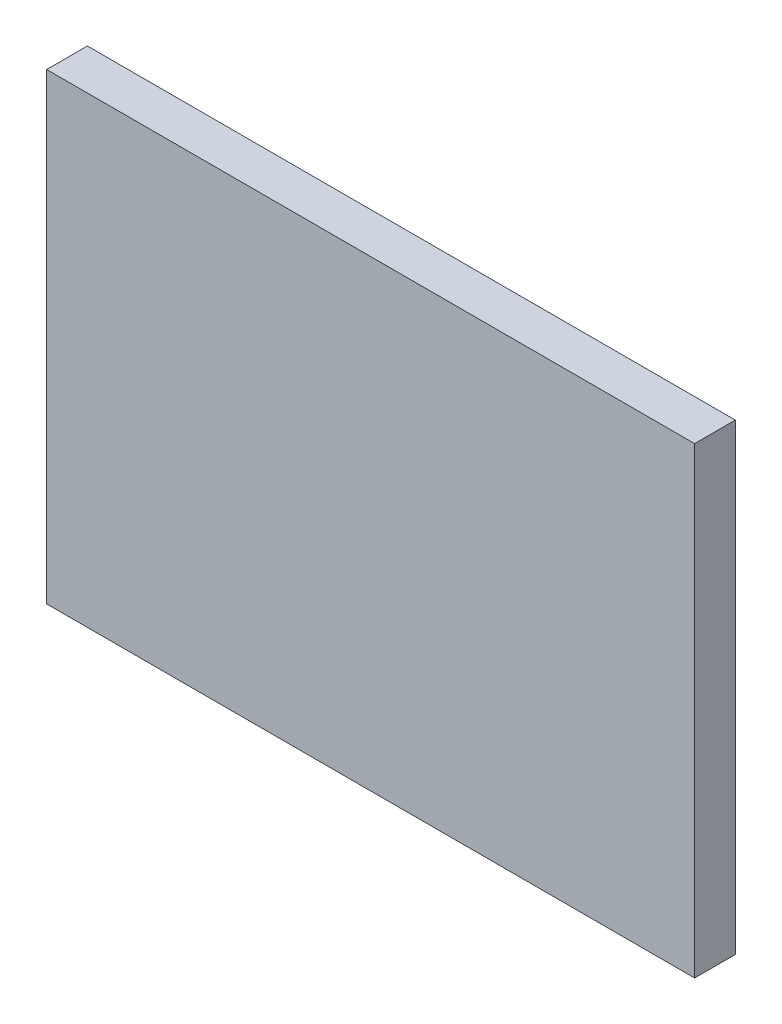
ISO-10303-21;
HEADER;
FILE_DESCRIPTION(('STEP AP214'),'2;1');
FILE_NAME('part.step','',(''),(''),'','','');
FILE_SCHEMA(('AUTOMOTIVE_DESIGN { 1 0 10303 214 1 1 1 1 }'));
ENDSEC;
DATA;
#1=APPLICATION_CONTEXT('core data for automotive mechanical design processes');
#2=APPLICATION_PROTOCOL_DEFINITION('international standard','automotive_design',2000,#1);
#3=PRODUCT_CONTEXT('',#1,'mechanical');
#4=PRODUCT('Part','Part','',(#3));
#5=PRODUCT_RELATED_PRODUCT_CATEGORY('part','',(#4));
#6=PRODUCT_DEFINITION_FORMATION('','',#4);
#7=PRODUCT_DEFINITION_CONTEXT('part definition',#1,'design');
#8=PRODUCT_DEFINITION('design','',#6,#7);
#9=PRODUCT_DEFINITION_SHAPE('','',#8);
#10=(LENGTH_UNIT() NAMED_UNIT(*) SI_UNIT(.MILLI.,.METRE.));
#11=(NAMED_UNIT(*) PLANE_ANGLE_UNIT() SI_UNIT($,.RADIAN.));
#12=(NAMED_UNIT(*) SI_UNIT($,.STERADIAN.) SOLID_ANGLE_UNIT());
#13=UNCERTAINTY_MEASURE_WITH_UNIT(LENGTH_MEASURE(1.E-05),#10,'distance_accuracy_value','');
#14=(GEOMETRIC_REPRESENTATION_CONTEXT(3) GLOBAL_UNCERTAINTY_ASSIGNED_CONTEXT((#13)) GLOBAL_UNIT_ASSIGNED_CONTEXT((#10,
#11,#12)) REPRESENTATION_CONTEXT('',''));
#15=CARTESIAN_POINT('',(0.,0.,0.));
#16=DIRECTION('',(0.,0.,1.));
#17=DIRECTION('',(1.,0.,0.));
#18=AXIS2_PLACEMENT_3D('',#15,#16,#17);
#19=CARTESIAN_POINT('',(8.75,-6.25,1.1));
#20=DIRECTION('',(-1.,0.,0.));
#21=DIRECTION('',(0.,0.,1.));
#22=AXIS2_PLACEMENT_3D('',#19,#20,#21);
#23=PLANE('',#22);
#24=DIRECTION('',(0.,1.,0.));
#25=VECTOR('',#24,1.);
#26=CARTESIAN_POINT('',(8.75,-6.25,0.));
#27=LINE('',#26,#25);
#28=CARTESIAN_POINT('',(8.75,-6.25,0.));
#29=VERTEX_POINT('',#28);
#30=CARTESIAN_POINT('',(8.75,6.25,0.));
#31=VERTEX_POINT('',#30);
#32=EDGE_CURVE('E109',#29,#31,#27,.T.);
#33=ORIENTED_EDGE('',*,*,#32,.T.);
#34=DIRECTION('',(0.,0.,-1.));
#35=VECTOR('',#34,1.);
#36=CARTESIAN_POINT('',(8.75,6.25,1.1));
#37=LINE('',#36,#35);
#38=CARTESIAN_POINT('',(8.75,6.25,1.1));
#39=VERTEX_POINT('',#38);
#40=EDGE_CURVE('E11',#39,#31,#37,.T.);
#41=ORIENTED_EDGE('',*,*,#40,.F.);
#42=DIRECTION('',(0.,1.,0.));
#43=VECTOR('',#42,1.);
#44=CARTESIAN_POINT('',(8.75,-6.25,1.1));
#45=LINE('',#44,#43);
#46=CARTESIAN_POINT('',(8.75,-6.25,1.1));
#47=VERTEX_POINT('',#46);
#48=EDGE_CURVE('E91',#47,#39,#45,.T.);
#49=ORIENTED_EDGE('',*,*,#48,.F.);
#50=DIRECTION('',(0.,0.,-1.));
#51=VECTOR('',#50,1.);
#52=CARTESIAN_POINT('',(8.75,-6.25,1.1));
#53=LINE('',#52,#51);
#54=EDGE_CURVE('E105',#47,#29,#53,.T.);
#55=ORIENTED_EDGE('',*,*,#54,.T.);
#56=EDGE_LOOP('',(#33,#41,#49,#55));
#57=FACE_BOUND('',#56,.T.);
#58=ADVANCED_FACE('F39',(#57),#23,.F.);
#59=CARTESIAN_POINT('',(-8.75,6.25,1.1));
#60=DIRECTION('',(0.,-1.,0.));
#61=DIRECTION('',(0.,0.,-1.));
#62=AXIS2_PLACEMENT_3D('',#59,#60,#61);
#63=PLANE('',#62);
#64=DIRECTION('',(-1.,0.,0.));
#65=VECTOR('',#64,1.);
#66=CARTESIAN_POINT('',(-8.75,6.25,0.));
#67=LINE('',#66,#65);
#68=CARTESIAN_POINT('',(-8.75,6.25,0.));
#69=VERTEX_POINT('',#68);
#70=EDGE_CURVE('E96',#31,#69,#67,.T.);
#71=ORIENTED_EDGE('',*,*,#70,.T.);
#72=DIRECTION('',(0.,0.,-1.));
#73=VECTOR('',#72,1.);
#74=CARTESIAN_POINT('',(-8.75,6.25,1.1));
#75=LINE('',#74,#73);
#76=CARTESIAN_POINT('',(-8.75,6.25,1.1));
#77=VERTEX_POINT('',#76);
#78=EDGE_CURVE('E48',#77,#69,#75,.T.);
#79=ORIENTED_EDGE('',*,*,#78,.F.);
#80=DIRECTION('',(-1.,0.,0.));
#81=VECTOR('',#80,1.);
#82=CARTESIAN_POINT('',(-8.75,6.25,1.1));
#83=LINE('',#82,#81);
#84=EDGE_CURVE('E86',#39,#77,#83,.T.);
#85=ORIENTED_EDGE('',*,*,#84,.F.);
#86=ORIENTED_EDGE('',*,*,#40,.T.);
#87=EDGE_LOOP('',(#71,#79,#85,#86));
#88=FACE_BOUND('',#87,.T.);
#89=ADVANCED_FACE('F95',(#88),#63,.F.);
#90=CARTESIAN_POINT('',(-8.75,-6.25,1.1));
#91=DIRECTION('',(1.,0.,0.));
#92=DIRECTION('',(0.,0.,-1.));
#93=AXIS2_PLACEMENT_3D('',#90,#91,#92);
#94=PLANE('',#93);
#95=DIRECTION('',(0.,-1.,0.));
#96=VECTOR('',#95,1.);
#97=CARTESIAN_POINT('',(-8.75,-6.25,0.));
#98=LINE('',#97,#96);
#99=CARTESIAN_POINT('',(-8.75,-6.25,0.));
#100=VERTEX_POINT('',#99);
#101=EDGE_CURVE('E73',#69,#100,#98,.T.);
#102=ORIENTED_EDGE('',*,*,#101,.T.);
#103=DIRECTION('',(0.,0.,-1.));
#104=VECTOR('',#103,1.);
#105=CARTESIAN_POINT('',(-8.75,-6.25,1.1));
#106=LINE('',#105,#104);
#107=CARTESIAN_POINT('',(-8.75,-6.25,1.1));
#108=VERTEX_POINT('',#107);
#109=EDGE_CURVE('E98',#108,#100,#106,.T.);
#110=ORIENTED_EDGE('',*,*,#109,.F.);
#111=DIRECTION('',(0.,-1.,0.));
#112=VECTOR('',#111,1.);
#113=CARTESIAN_POINT('',(-8.75,-6.25,1.1));
#114=LINE('',#113,#112);
#115=EDGE_CURVE('E89',#77,#108,#114,.T.);
#116=ORIENTED_EDGE('',*,*,#115,.F.);
#117=ORIENTED_EDGE('',*,*,#78,.T.);
#118=EDGE_LOOP('',(#102,#110,#116,#117));
#119=FACE_BOUND('',#118,.T.);
#120=ADVANCED_FACE('F99',(#119),#94,.F.);
#121=CARTESIAN_POINT('',(-8.75,-6.25,1.1));
#122=DIRECTION('',(0.,1.,0.));
#123=DIRECTION('',(0.,0.,1.));
#124=AXIS2_PLACEMENT_3D('',#121,#122,#123);
#125=PLANE('',#124);
#126=DIRECTION('',(1.,0.,0.));
#127=VECTOR('',#126,1.);
#128=CARTESIAN_POINT('',(-8.75,-6.25,0.));
#129=LINE('',#128,#127);
#130=EDGE_CURVE('E79',#100,#29,#129,.T.);
#131=ORIENTED_EDGE('',*,*,#130,.T.);
#132=ORIENTED_EDGE('',*,*,#54,.F.);
#133=DIRECTION('',(1.,0.,0.));
#134=VECTOR('',#133,1.);
#135=CARTESIAN_POINT('',(-8.75,-6.25,1.1));
#136=LINE('',#135,#134);
#137=EDGE_CURVE('E56',#108,#47,#136,.T.);
#138=ORIENTED_EDGE('',*,*,#137,.F.);
#139=ORIENTED_EDGE('',*,*,#109,.T.);
#140=EDGE_LOOP('',(#131,#132,#138,#139));
#141=FACE_BOUND('',#140,.T.);
#142=ADVANCED_FACE('F120',(#141),#125,.F.);
#143=CARTESIAN_POINT('',(0.,0.,1.1));
#144=DIRECTION('',(0.,0.,-1.));
#145=DIRECTION('',(-1.,0.,0.));
#146=AXIS2_PLACEMENT_3D('',#143,#144,#145);
#147=PLANE('',#146);
#148=ORIENTED_EDGE('',*,*,#48,.T.);
#149=ORIENTED_EDGE('',*,*,#84,.T.);
#150=ORIENTED_EDGE('',*,*,#115,.T.);
#151=ORIENTED_EDGE('',*,*,#137,.T.);
#152=EDGE_LOOP('',(#148,#149,#150,#151));
#153=FACE_BOUND('',#152,.T.);
#154=ADVANCED_FACE('F87',(#153),#147,.F.);
#155=CARTESIAN_POINT('',(0.,0.,0.));
#156=DIRECTION('',(0.,0.,-1.));
#157=DIRECTION('',(-1.,0.,0.));
#158=AXIS2_PLACEMENT_3D('',#155,#156,#157);
#159=PLANE('',#158);
#160=ORIENTED_EDGE('',*,*,#32,.F.);
#161=ORIENTED_EDGE('',*,*,#130,.F.);
#162=ORIENTED_EDGE('',*,*,#101,.F.);
#163=ORIENTED_EDGE('',*,*,#70,.F.);
#164=EDGE_LOOP('',(#160,#161,#162,#163));
#165=FACE_BOUND('',#164,.T.);
#166=ADVANCED_FACE('F123',(#165),#159,.T.);
#167=CLOSED_SHELL('',(#58,#89,#120,#142,#154,#166));
#168=MANIFOLD_SOLID_BREP('B2',#167);
#169=ADVANCED_BREP_SHAPE_REPRESENTATION('',(#18,#168),#14);
#170=SHAPE_DEFINITION_REPRESENTATION(#9,#169);
ENDSEC;
END-ISO-10303-21;
